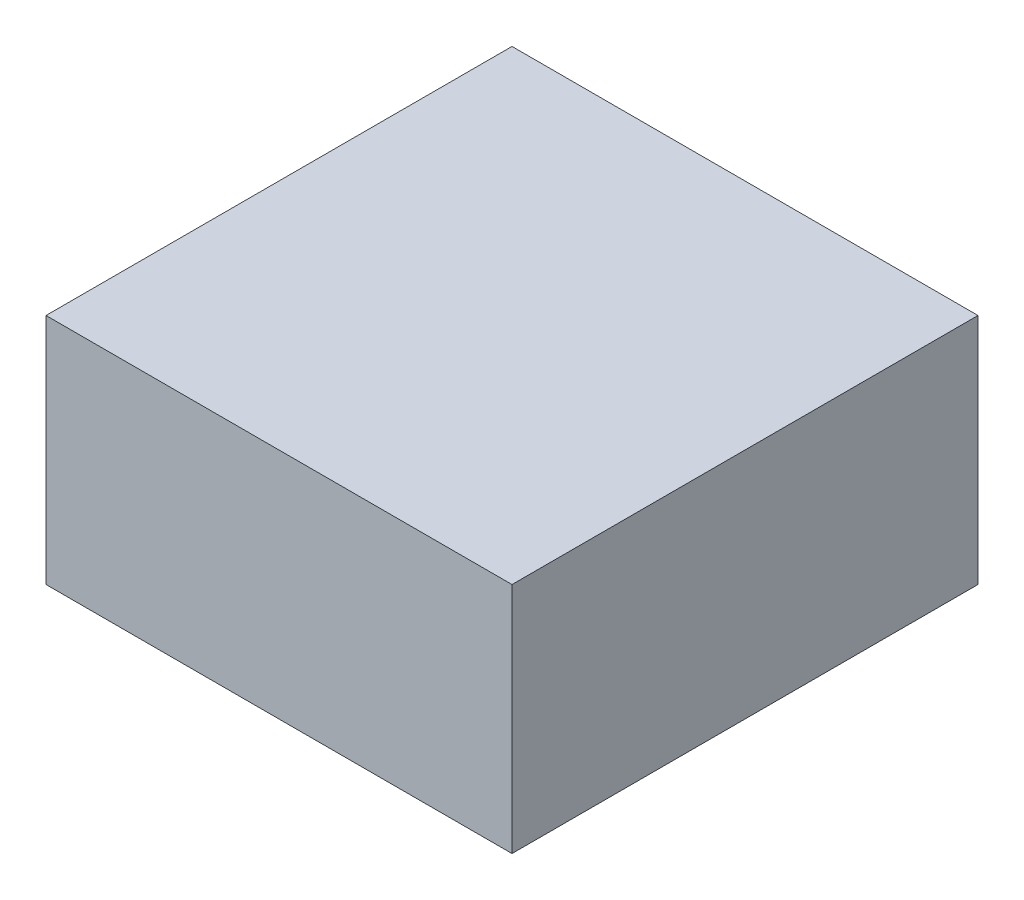
ISO-10303-21;
HEADER;
FILE_DESCRIPTION(('STEP AP214'),'2;1');
FILE_NAME('part.step','',(''),(''),'','','');
FILE_SCHEMA(('AUTOMOTIVE_DESIGN { 1 0 10303 214 1 1 1 1 }'));
ENDSEC;
DATA;
#1=APPLICATION_CONTEXT('core data for automotive mechanical design processes');
#2=APPLICATION_PROTOCOL_DEFINITION('international standard','automotive_design',2000,#1);
#3=PRODUCT_CONTEXT('',#1,'mechanical');
#4=PRODUCT('Part','Part','',(#3));
#5=PRODUCT_RELATED_PRODUCT_CATEGORY('part','',(#4));
#6=PRODUCT_DEFINITION_FORMATION('','',#4);
#7=PRODUCT_DEFINITION_CONTEXT('part definition',#1,'design');
#8=PRODUCT_DEFINITION('design','',#6,#7);
#9=PRODUCT_DEFINITION_SHAPE('','',#8);
#10=(LENGTH_UNIT() NAMED_UNIT(*) SI_UNIT(.MILLI.,.METRE.));
#11=(NAMED_UNIT(*) PLANE_ANGLE_UNIT() SI_UNIT($,.RADIAN.));
#12=(NAMED_UNIT(*) SI_UNIT($,.STERADIAN.) SOLID_ANGLE_UNIT());
#13=UNCERTAINTY_MEASURE_WITH_UNIT(LENGTH_MEASURE(1.E-05),#10,'distance_accuracy_value','');
#14=(GEOMETRIC_REPRESENTATION_CONTEXT(3) GLOBAL_UNCERTAINTY_ASSIGNED_CONTEXT((#13)) GLOBAL_UNIT_ASSIGNED_CONTEXT((#10,
#11,#12)) REPRESENTATION_CONTEXT('',''));
#15=CARTESIAN_POINT('',(0.,0.,0.));
#16=DIRECTION('',(0.,0.,1.));
#17=DIRECTION('',(1.,0.,0.));
#18=AXIS2_PLACEMENT_3D('',#15,#16,#17);
#19=CARTESIAN_POINT('',(0.,50.,0.));
#20=DIRECTION('',(1.,0.,0.));
#21=DIRECTION('',(0.,0.,-1.));
#22=AXIS2_PLACEMENT_3D('',#19,#20,#21);
#23=PLANE('',#22);
#24=DIRECTION('',(0.,0.,1.));
#25=VECTOR('',#24,1.);
#26=CARTESIAN_POINT('',(0.,0.,0.));
#27=LINE('',#26,#25);
#28=CARTESIAN_POINT('',(0.,0.,-100.));
#29=VERTEX_POINT('',#28);
#30=CARTESIAN_POINT('',(0.,0.,0.));
#31=VERTEX_POINT('',#30);
#32=EDGE_CURVE('E96',#29,#31,#27,.T.);
#33=ORIENTED_EDGE('',*,*,#32,.T.);
#34=DIRECTION('',(0.,-1.,0.));
#35=VECTOR('',#34,1.);
#36=CARTESIAN_POINT('',(0.,50.,0.));
#37=LINE('',#36,#35);
#38=CARTESIAN_POINT('',(0.,50.,0.));
#39=VERTEX_POINT('',#38);
#40=EDGE_CURVE('E11',#39,#31,#37,.T.);
#41=ORIENTED_EDGE('',*,*,#40,.F.);
#42=DIRECTION('',(0.,0.,1.));
#43=VECTOR('',#42,1.);
#44=CARTESIAN_POINT('',(0.,50.,0.));
#45=LINE('',#44,#43);
#46=CARTESIAN_POINT('',(0.,50.,-100.));
#47=VERTEX_POINT('',#46);
#48=EDGE_CURVE('E84',#47,#39,#45,.T.);
#49=ORIENTED_EDGE('',*,*,#48,.F.);
#50=DIRECTION('',(0.,-1.,0.));
#51=VECTOR('',#50,1.);
#52=CARTESIAN_POINT('',(0.,50.,-100.));
#53=LINE('',#52,#51);
#54=EDGE_CURVE('E92',#47,#29,#53,.T.);
#55=ORIENTED_EDGE('',*,*,#54,.T.);
#56=EDGE_LOOP('',(#33,#41,#49,#55));
#57=FACE_BOUND('',#56,.T.);
#58=ADVANCED_FACE('F33',(#57),#23,.F.);
#59=CARTESIAN_POINT('',(0.,50.,0.));
#60=DIRECTION('',(0.,0.,-1.));
#61=DIRECTION('',(-1.,0.,0.));
#62=AXIS2_PLACEMENT_3D('',#59,#60,#61);
#63=PLANE('',#62);
#64=DIRECTION('',(1.,0.,0.));
#65=VECTOR('',#64,1.);
#66=CARTESIAN_POINT('',(0.,0.,0.));
#67=LINE('',#66,#65);
#68=CARTESIAN_POINT('',(100.,0.,0.));
#69=VERTEX_POINT('',#68);
#70=EDGE_CURVE('E88',#31,#69,#67,.T.);
#71=ORIENTED_EDGE('',*,*,#70,.T.);
#72=DIRECTION('',(0.,-1.,0.));
#73=VECTOR('',#72,1.);
#74=CARTESIAN_POINT('',(100.,50.,0.));
#75=LINE('',#74,#73);
#76=CARTESIAN_POINT('',(100.,50.,0.));
#77=VERTEX_POINT('',#76);
#78=EDGE_CURVE('E41',#77,#69,#75,.T.);
#79=ORIENTED_EDGE('',*,*,#78,.F.);
#80=DIRECTION('',(1.,0.,0.));
#81=VECTOR('',#80,1.);
#82=CARTESIAN_POINT('',(0.,50.,0.));
#83=LINE('',#82,#81);
#84=EDGE_CURVE('E79',#39,#77,#83,.T.);
#85=ORIENTED_EDGE('',*,*,#84,.F.);
#86=ORIENTED_EDGE('',*,*,#40,.T.);
#87=EDGE_LOOP('',(#71,#79,#85,#86));
#88=FACE_BOUND('',#87,.T.);
#89=ADVANCED_FACE('F87',(#88),#63,.F.);
#90=CARTESIAN_POINT('',(100.,50.,0.));
#91=DIRECTION('',(-1.,0.,0.));
#92=DIRECTION('',(0.,0.,1.));
#93=AXIS2_PLACEMENT_3D('',#90,#91,#92);
#94=PLANE('',#93);
#95=DIRECTION('',(0.,0.,-1.));
#96=VECTOR('',#95,1.);
#97=CARTESIAN_POINT('',(100.,0.,0.));
#98=LINE('',#97,#96);
#99=CARTESIAN_POINT('',(100.,0.,-100.));
#100=VERTEX_POINT('',#99);
#101=EDGE_CURVE('E66',#69,#100,#98,.T.);
#102=ORIENTED_EDGE('',*,*,#101,.T.);
#103=DIRECTION('',(0.,-1.,0.));
#104=VECTOR('',#103,1.);
#105=CARTESIAN_POINT('',(100.,50.,-100.));
#106=LINE('',#105,#104);
#107=CARTESIAN_POINT('',(100.,50.,-100.));
#108=VERTEX_POINT('',#107);
#109=EDGE_CURVE('E89',#108,#100,#106,.T.);
#110=ORIENTED_EDGE('',*,*,#109,.F.);
#111=DIRECTION('',(0.,0.,-1.));
#112=VECTOR('',#111,1.);
#113=CARTESIAN_POINT('',(100.,50.,0.));
#114=LINE('',#113,#112);
#115=EDGE_CURVE('E82',#77,#108,#114,.T.);
#116=ORIENTED_EDGE('',*,*,#115,.F.);
#117=ORIENTED_EDGE('',*,*,#78,.T.);
#118=EDGE_LOOP('',(#102,#110,#116,#117));
#119=FACE_BOUND('',#118,.T.);
#120=ADVANCED_FACE('F90',(#119),#94,.F.);
#121=CARTESIAN_POINT('',(0.,50.,-100.));
#122=DIRECTION('',(0.,0.,1.));
#123=DIRECTION('',(1.,0.,0.));
#124=AXIS2_PLACEMENT_3D('',#121,#122,#123);
#125=PLANE('',#124);
#126=DIRECTION('',(-1.,0.,0.));
#127=VECTOR('',#126,1.);
#128=CARTESIAN_POINT('',(0.,0.,-100.));
#129=LINE('',#128,#127);
#130=EDGE_CURVE('E72',#100,#29,#129,.T.);
#131=ORIENTED_EDGE('',*,*,#130,.T.);
#132=ORIENTED_EDGE('',*,*,#54,.F.);
#133=DIRECTION('',(-1.,0.,0.));
#134=VECTOR('',#133,1.);
#135=CARTESIAN_POINT('',(0.,50.,-100.));
#136=LINE('',#135,#134);
#137=EDGE_CURVE('E49',#108,#47,#136,.T.);
#138=ORIENTED_EDGE('',*,*,#137,.F.);
#139=ORIENTED_EDGE('',*,*,#109,.T.);
#140=EDGE_LOOP('',(#131,#132,#138,#139));
#141=FACE_BOUND('',#140,.T.);
#142=ADVANCED_FACE('F103',(#141),#125,.F.);
#143=CARTESIAN_POINT('',(0.,50.,0.));
#144=DIRECTION('',(0.,-1.,0.));
#145=DIRECTION('',(0.,0.,-1.));
#146=AXIS2_PLACEMENT_3D('',#143,#144,#145);
#147=PLANE('',#146);
#148=ORIENTED_EDGE('',*,*,#48,.T.);
#149=ORIENTED_EDGE('',*,*,#84,.T.);
#150=ORIENTED_EDGE('',*,*,#115,.T.);
#151=ORIENTED_EDGE('',*,*,#137,.T.);
#152=EDGE_LOOP('',(#148,#149,#150,#151));
#153=FACE_BOUND('',#152,.T.);
#154=ADVANCED_FACE('F80',(#153),#147,.F.);
#155=CARTESIAN_POINT('',(0.,0.,0.));
#156=DIRECTION('',(0.,-1.,0.));
#157=DIRECTION('',(0.,0.,-1.));
#158=AXIS2_PLACEMENT_3D('',#155,#156,#157);
#159=PLANE('',#158);
#160=ORIENTED_EDGE('',*,*,#32,.F.);
#161=ORIENTED_EDGE('',*,*,#130,.F.);
#162=ORIENTED_EDGE('',*,*,#101,.F.);
#163=ORIENTED_EDGE('',*,*,#70,.F.);
#164=EDGE_LOOP('',(#160,#161,#162,#163));
#165=FACE_BOUND('',#164,.T.);
#166=ADVANCED_FACE('F106',(#165),#159,.T.);
#167=CLOSED_SHELL('',(#58,#89,#120,#142,#154,#166));
#168=MANIFOLD_SOLID_BREP('B2',#167);
#169=ADVANCED_BREP_SHAPE_REPRESENTATION('',(#18,#168),#14);
#170=SHAPE_DEFINITION_REPRESENTATION(#9,#169);
ENDSEC;
END-ISO-10303-21;
